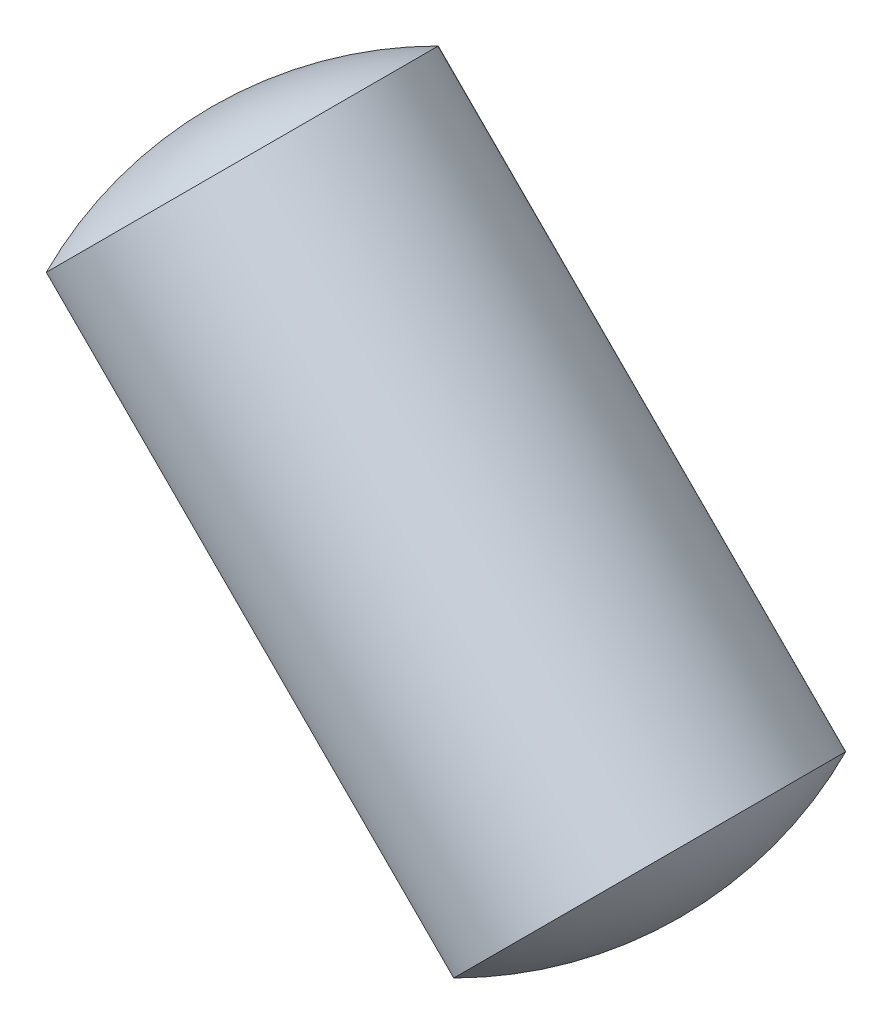
ISO-10303-21;
HEADER;
FILE_DESCRIPTION(('STEP AP214'),'2;1');
FILE_NAME('part.step','',(''),(''),'','','');
FILE_SCHEMA(('AUTOMOTIVE_DESIGN { 1 0 10303 214 1 1 1 1 }'));
ENDSEC;
DATA;
#1=APPLICATION_CONTEXT('core data for automotive mechanical design processes');
#2=APPLICATION_PROTOCOL_DEFINITION('international standard','automotive_design',2000,#1);
#3=PRODUCT_CONTEXT('',#1,'mechanical');
#4=PRODUCT('Part','Part','',(#3));
#5=PRODUCT_RELATED_PRODUCT_CATEGORY('part','',(#4));
#6=PRODUCT_DEFINITION_FORMATION('','',#4);
#7=PRODUCT_DEFINITION_CONTEXT('part definition',#1,'design');
#8=PRODUCT_DEFINITION('design','',#6,#7);
#9=PRODUCT_DEFINITION_SHAPE('','',#8);
#10=(LENGTH_UNIT() NAMED_UNIT(*) SI_UNIT(.MILLI.,.METRE.));
#11=(NAMED_UNIT(*) PLANE_ANGLE_UNIT() SI_UNIT($,.RADIAN.));
#12=(NAMED_UNIT(*) SI_UNIT($,.STERADIAN.) SOLID_ANGLE_UNIT());
#13=UNCERTAINTY_MEASURE_WITH_UNIT(LENGTH_MEASURE(1.E-05),#10,'distance_accuracy_value','');
#14=(GEOMETRIC_REPRESENTATION_CONTEXT(3) GLOBAL_UNCERTAINTY_ASSIGNED_CONTEXT((#13)) GLOBAL_UNIT_ASSIGNED_CONTEXT((#10,
#11,#12)) REPRESENTATION_CONTEXT('',''));
#15=CARTESIAN_POINT('',(0.,0.,0.));
#16=DIRECTION('',(0.,0.,1.));
#17=DIRECTION('',(1.,0.,0.));
#18=AXIS2_PLACEMENT_3D('',#15,#16,#17);
#19=CARTESIAN_POINT('',(19.5175074847464,-19.5175074847464,0.9));
#20=DIRECTION('',(-0.707106781186548,-0.707106781186548,0.));
#21=DIRECTION('',(0.707106781186548,-0.707106781186548,0.));
#22=AXIS2_PLACEMENT_3D('',#19,#20,#21);
#23=SPHERICAL_SURFACE('',#22,3.);
#24=CARTESIAN_POINT('',(19.5175074847464,-19.5175074847464,0.9));
#25=DIRECTION('',(-0.707106781186548,0.707106781186547,0.));
#26=DIRECTION('',(0.,0.,-1.));
#27=AXIS2_PLACEMENT_3D('',#24,#25,#26);
#28=SPHERICAL_SURFACE('',#27,3.);
#29=CARTESIAN_POINT('',(21.3546247918337,-21.3546247918337,0.9));
#30=DIRECTION('',(-0.707106781186548,0.707106781186547,0.));
#31=DIRECTION('',(0.,0.,-1.));
#32=AXIS2_PLACEMENT_3D('',#29,#30,#31);
#33=CIRCLE('',#32,1.5);
#34=CARTESIAN_POINT('',(21.3546247918337,-21.3546247918337,-0.6));
#35=VERTEX_POINT('',#34);
#36=EDGE_CURVE('E11',#35,#35,#33,.T.);
#37=ORIENTED_EDGE('',*,*,#36,.F.);
#38=EDGE_LOOP('',(#37));
#39=FACE_BOUND('',#38,.T.);
#40=ADVANCED_FACE('F17',(#39),#28,.T.);
#41=CARTESIAN_POINT('',(19.3733654805138,-19.3733654805139,0.9));
#42=DIRECTION('',(-0.707106781186548,-0.707106781186548,0.));
#43=DIRECTION('',(-0.707106781186548,0.707106781186548,0.));
#44=AXIS2_PLACEMENT_3D('',#41,#42,#43);
#45=SPHERICAL_SURFACE('',#44,3.);
#46=CARTESIAN_POINT('',(19.3733654805138,-19.3733654805139,0.9));
#47=DIRECTION('',(-0.707106781186548,0.707106781186547,0.));
#48=DIRECTION('',(0.,0.,-1.));
#49=AXIS2_PLACEMENT_3D('',#46,#47,#48);
#50=SPHERICAL_SURFACE('',#49,3.);
#51=CARTESIAN_POINT('',(17.5362481734264,-17.5362481734264,0.9));
#52=DIRECTION('',(-0.707106781186548,0.707106781186547,0.));
#53=DIRECTION('',(0.,0.,-1.));
#54=AXIS2_PLACEMENT_3D('',#51,#52,#53);
#55=CIRCLE('',#54,1.5);
#56=CARTESIAN_POINT('',(17.5362481734264,-17.5362481734264,-0.6));
#57=VERTEX_POINT('',#56);
#58=EDGE_CURVE('E20',#57,#57,#55,.T.);
#59=ORIENTED_EDGE('',*,*,#58,.T.);
#60=EDGE_LOOP('',(#59));
#61=FACE_BOUND('',#60,.T.);
#62=ADVANCED_FACE('F39',(#61),#50,.T.);
#63=CARTESIAN_POINT('',(18.4908423280282,-18.4908423280282,0.9));
#64=DIRECTION('',(-0.707106781186548,0.707106781186547,0.));
#65=DIRECTION('',(0.,0.,-1.));
#66=AXIS2_PLACEMENT_3D('',#63,#64,#65);
#67=CYLINDRICAL_SURFACE('',#66,1.5);
#68=ORIENTED_EDGE('',*,*,#36,.T.);
#69=EDGE_LOOP('',(#68));
#70=FACE_BOUND('',#69,.T.);
#71=ORIENTED_EDGE('',*,*,#58,.F.);
#72=EDGE_LOOP('',(#71));
#73=FACE_BOUND('',#72,.T.);
#74=ADVANCED_FACE('F51',(#70,#73),#67,.T.);
#75=CLOSED_SHELL('',(#40,#62,#74));
#76=MANIFOLD_SOLID_BREP('B1',#75);
#77=ADVANCED_BREP_SHAPE_REPRESENTATION('',(#18,#76),#14);
#78=SHAPE_DEFINITION_REPRESENTATION(#9,#77);
ENDSEC;
END-ISO-10303-21;
